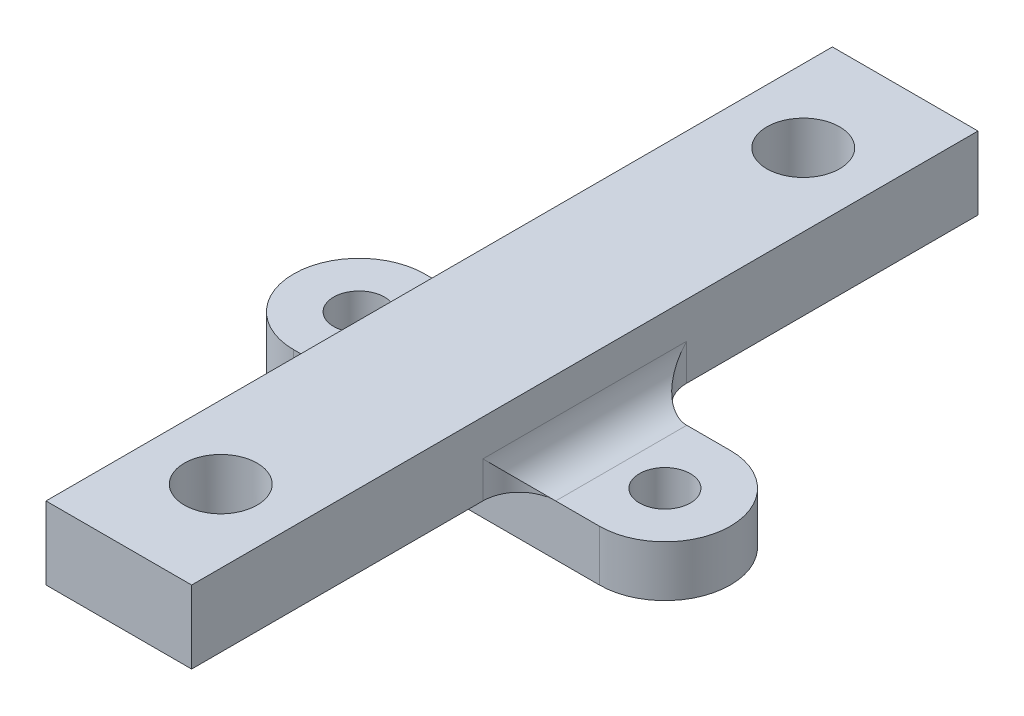
ISO-10303-21;
HEADER;
FILE_DESCRIPTION(('STEP AP214'),'2;1');
FILE_NAME('part.step','',(''),(''),'','','');
FILE_SCHEMA(('AUTOMOTIVE_DESIGN { 1 0 10303 214 1 1 1 1 }'));
ENDSEC;
DATA;
#1=APPLICATION_CONTEXT('core data for automotive mechanical design processes');
#2=APPLICATION_PROTOCOL_DEFINITION('international standard','automotive_design',2000,#1);
#3=PRODUCT_CONTEXT('',#1,'mechanical');
#4=PRODUCT('Part','Part','',(#3));
#5=PRODUCT_RELATED_PRODUCT_CATEGORY('part','',(#4));
#6=PRODUCT_DEFINITION_FORMATION('','',#4);
#7=PRODUCT_DEFINITION_CONTEXT('part definition',#1,'design');
#8=PRODUCT_DEFINITION('design','',#6,#7);
#9=PRODUCT_DEFINITION_SHAPE('','',#8);
#10=(LENGTH_UNIT() NAMED_UNIT(*) SI_UNIT(.MILLI.,.METRE.));
#11=(NAMED_UNIT(*) PLANE_ANGLE_UNIT() SI_UNIT($,.RADIAN.));
#12=(NAMED_UNIT(*) SI_UNIT($,.STERADIAN.) SOLID_ANGLE_UNIT());
#13=UNCERTAINTY_MEASURE_WITH_UNIT(LENGTH_MEASURE(1.E-05),#10,'distance_accuracy_value','');
#14=(GEOMETRIC_REPRESENTATION_CONTEXT(3) GLOBAL_UNCERTAINTY_ASSIGNED_CONTEXT((#13)) GLOBAL_UNIT_ASSIGNED_CONTEXT((#10,
#11,#12)) REPRESENTATION_CONTEXT('',''));
#15=CARTESIAN_POINT('',(0.,0.,0.));
#16=DIRECTION('',(0.,0.,1.));
#17=DIRECTION('',(1.,0.,0.));
#18=AXIS2_PLACEMENT_3D('',#15,#16,#17);
#19=CARTESIAN_POINT('',(-21.,7.,9.));
#20=DIRECTION('',(0.,0.,-1.));
#21=DIRECTION('',(-1.,0.,0.));
#22=AXIS2_PLACEMENT_3D('',#19,#20,#21);
#23=PLANE('',#22);
#24=DIRECTION('',(1.,0.,0.));
#25=VECTOR('',#24,1.);
#26=CARTESIAN_POINT('',(-10.,7.,9.));
#27=LINE('',#26,#25);
#28=CARTESIAN_POINT('',(-15.,7.,9.));
#29=VERTEX_POINT('',#28);
#30=CARTESIAN_POINT('',(15.,7.,9.));
#31=VERTEX_POINT('',#30);
#32=EDGE_CURVE('E183',#29,#31,#27,.T.);
#33=ORIENTED_EDGE('',*,*,#32,.F.);
#34=DIRECTION('',(1.,0.,0.));
#35=VECTOR('',#34,1.);
#36=CARTESIAN_POINT('',(-21.,7.,9.));
#37=LINE('',#36,#35);
#38=CARTESIAN_POINT('',(-21.,7.,9.));
#39=VERTEX_POINT('',#38);
#40=EDGE_CURVE('E244',#39,#29,#37,.T.);
#41=ORIENTED_EDGE('',*,*,#40,.F.);
#42=DIRECTION('',(0.,-1.,0.));
#43=VECTOR('',#42,1.);
#44=CARTESIAN_POINT('',(-21.,7.,9.));
#45=LINE('',#44,#43);
#46=CARTESIAN_POINT('',(-21.,0.,9.));
#47=VERTEX_POINT('',#46);
#48=EDGE_CURVE('E257',#39,#47,#45,.T.);
#49=ORIENTED_EDGE('',*,*,#48,.T.);
#50=DIRECTION('',(1.,0.,0.));
#51=VECTOR('',#50,1.);
#52=CARTESIAN_POINT('',(-21.,0.,9.));
#53=LINE('',#52,#51);
#54=CARTESIAN_POINT('',(21.,0.,9.));
#55=VERTEX_POINT('',#54);
#56=EDGE_CURVE('E237',#47,#55,#53,.T.);
#57=ORIENTED_EDGE('',*,*,#56,.T.);
#58=DIRECTION('',(0.,-1.,0.));
#59=VECTOR('',#58,1.);
#60=CARTESIAN_POINT('',(21.,7.,9.));
#61=LINE('',#60,#59);
#62=CARTESIAN_POINT('',(21.,7.,9.));
#63=VERTEX_POINT('',#62);
#64=EDGE_CURVE('E247',#63,#55,#61,.T.);
#65=ORIENTED_EDGE('',*,*,#64,.F.);
#66=EDGE_CURVE('E243',#31,#63,#37,.T.);
#67=ORIENTED_EDGE('',*,*,#66,.F.);
#68=EDGE_LOOP('',(#33,#41,#49,#57,#65,#67));
#69=FACE_BOUND('',#68,.T.);
#70=ADVANCED_FACE('F43',(#69),#23,.F.);
#71=CARTESIAN_POINT('',(21.,7.,0.));
#72=DIRECTION('',(0.,-1.,0.));
#73=DIRECTION('',(0.,0.,-1.));
#74=AXIS2_PLACEMENT_3D('',#71,#72,#73);
#75=PLANE('',#74);
#76=CARTESIAN_POINT('',(21.,7.,0.));
#77=DIRECTION('',(0.,-1.,0.));
#78=DIRECTION('',(0.,0.,1.));
#79=AXIS2_PLACEMENT_3D('',#76,#77,#78);
#80=CIRCLE('',#79,3.5);
#81=CARTESIAN_POINT('',(21.,7.,3.5));
#82=VERTEX_POINT('',#81);
#83=EDGE_CURVE('E203',#82,#82,#80,.T.);
#84=ORIENTED_EDGE('',*,*,#83,.T.);
#85=EDGE_LOOP('',(#84));
#86=FACE_BOUND('',#85,.T.);
#87=DIRECTION('',(-1.,0.,0.));
#88=VECTOR('',#87,1.);
#89=CARTESIAN_POINT('',(-21.,7.,-9.));
#90=LINE('',#89,#88);
#91=CARTESIAN_POINT('',(21.,7.,-9.));
#92=VERTEX_POINT('',#91);
#93=CARTESIAN_POINT('',(15.,7.,-9.));
#94=VERTEX_POINT('',#93);
#95=EDGE_CURVE('E238',#92,#94,#90,.T.);
#96=ORIENTED_EDGE('',*,*,#95,.T.);
#97=DIRECTION('',(0.,0.,-1.));
#98=VECTOR('',#97,1.);
#99=CARTESIAN_POINT('',(15.,7.,9.));
#100=LINE('',#99,#98);
#101=EDGE_CURVE('E270',#94,#31,#100,.F.);
#102=ORIENTED_EDGE('',*,*,#101,.T.);
#103=ORIENTED_EDGE('',*,*,#66,.T.);
#104=CARTESIAN_POINT('',(21.,7.,0.));
#105=DIRECTION('',(0.,1.,0.));
#106=DIRECTION('',(0.,0.,-1.));
#107=AXIS2_PLACEMENT_3D('',#104,#105,#106);
#108=CIRCLE('',#107,9.);
#109=EDGE_CURVE('E233',#63,#92,#108,.T.);
#110=ORIENTED_EDGE('',*,*,#109,.T.);
#111=EDGE_LOOP('',(#96,#102,#103,#110));
#112=FACE_BOUND('',#111,.T.);
#113=ADVANCED_FACE('F311',(#86,#112),#75,.F.);
#114=CARTESIAN_POINT('',(-21.,7.,0.));
#115=DIRECTION('',(0.,1.,0.));
#116=DIRECTION('',(0.,0.,1.));
#117=AXIS2_PLACEMENT_3D('',#114,#115,#116);
#118=CIRCLE('',#117,3.5);
#119=CARTESIAN_POINT('',(-21.,7.,3.5));
#120=VERTEX_POINT('',#119);
#121=EDGE_CURVE('E218',#120,#120,#118,.T.);
#122=ORIENTED_EDGE('',*,*,#121,.F.);
#123=EDGE_LOOP('',(#122));
#124=FACE_BOUND('',#123,.T.);
#125=ORIENTED_EDGE('',*,*,#40,.T.);
#126=DIRECTION('',(0.,0.,1.));
#127=VECTOR('',#126,1.);
#128=CARTESIAN_POINT('',(-15.,7.,-9.));
#129=LINE('',#128,#127);
#130=CARTESIAN_POINT('',(-15.,7.,-9.));
#131=VERTEX_POINT('',#130);
#132=EDGE_CURVE('E275',#29,#131,#129,.F.);
#133=ORIENTED_EDGE('',*,*,#132,.T.);
#134=CARTESIAN_POINT('',(-21.,7.,-9.));
#135=VERTEX_POINT('',#134);
#136=EDGE_CURVE('E236',#131,#135,#90,.T.);
#137=ORIENTED_EDGE('',*,*,#136,.T.);
#138=CARTESIAN_POINT('',(-21.,7.,0.));
#139=DIRECTION('',(0.,1.,0.));
#140=DIRECTION('',(0.,0.,1.));
#141=AXIS2_PLACEMENT_3D('',#138,#139,#140);
#142=CIRCLE('',#141,9.);
#143=EDGE_CURVE('E241',#135,#39,#142,.T.);
#144=ORIENTED_EDGE('',*,*,#143,.T.);
#145=EDGE_LOOP('',(#125,#133,#137,#144));
#146=FACE_BOUND('',#145,.T.);
#147=ADVANCED_FACE('F333',(#124,#146),#75,.F.);
#148=CARTESIAN_POINT('',(21.,7.,0.));
#149=DIRECTION('',(0.,-1.,0.));
#150=DIRECTION('',(0.,0.,-1.));
#151=AXIS2_PLACEMENT_3D('',#148,#149,#150);
#152=CYLINDRICAL_SURFACE('',#151,9.);
#153=CARTESIAN_POINT('',(21.,0.,0.));
#154=DIRECTION('',(0.,1.,0.));
#155=DIRECTION('',(0.,0.,-1.));
#156=AXIS2_PLACEMENT_3D('',#153,#154,#155);
#157=CIRCLE('',#156,9.);
#158=CARTESIAN_POINT('',(21.,0.,-9.));
#159=VERTEX_POINT('',#158);
#160=EDGE_CURVE('E230',#55,#159,#157,.T.);
#161=ORIENTED_EDGE('',*,*,#160,.T.);
#162=DIRECTION('',(0.,-1.,0.));
#163=VECTOR('',#162,1.);
#164=CARTESIAN_POINT('',(21.,7.,-9.));
#165=LINE('',#164,#163);
#166=EDGE_CURVE('E263',#92,#159,#165,.T.);
#167=ORIENTED_EDGE('',*,*,#166,.F.);
#168=ORIENTED_EDGE('',*,*,#109,.F.);
#169=ORIENTED_EDGE('',*,*,#64,.T.);
#170=EDGE_LOOP('',(#161,#167,#168,#169));
#171=FACE_BOUND('',#170,.T.);
#172=ADVANCED_FACE('F369',(#171),#152,.T.);
#173=CARTESIAN_POINT('',(-21.,7.,-9.));
#174=DIRECTION('',(0.,0.,1.));
#175=DIRECTION('',(1.,0.,0.));
#176=AXIS2_PLACEMENT_3D('',#173,#174,#175);
#177=PLANE('',#176);
#178=ORIENTED_EDGE('',*,*,#136,.F.);
#179=DIRECTION('',(1.,0.,0.));
#180=VECTOR('',#179,1.);
#181=CARTESIAN_POINT('',(-10.,7.,-9.));
#182=LINE('',#181,#180);
#183=EDGE_CURVE('E167',#131,#94,#182,.T.);
#184=ORIENTED_EDGE('',*,*,#183,.T.);
#185=ORIENTED_EDGE('',*,*,#95,.F.);
#186=ORIENTED_EDGE('',*,*,#166,.T.);
#187=DIRECTION('',(-1.,0.,0.));
#188=VECTOR('',#187,1.);
#189=CARTESIAN_POINT('',(-21.,0.,-9.));
#190=LINE('',#189,#188);
#191=CARTESIAN_POINT('',(-21.,0.,-9.));
#192=VERTEX_POINT('',#191);
#193=EDGE_CURVE('E250',#159,#192,#190,.T.);
#194=ORIENTED_EDGE('',*,*,#193,.T.);
#195=DIRECTION('',(0.,-1.,0.));
#196=VECTOR('',#195,1.);
#197=CARTESIAN_POINT('',(-21.,7.,-9.));
#198=LINE('',#197,#196);
#199=EDGE_CURVE('E260',#135,#192,#198,.T.);
#200=ORIENTED_EDGE('',*,*,#199,.F.);
#201=EDGE_LOOP('',(#178,#184,#185,#186,#194,#200));
#202=FACE_BOUND('',#201,.T.);
#203=ADVANCED_FACE('F337',(#202),#177,.F.);
#204=CARTESIAN_POINT('',(-21.,7.,0.));
#205=DIRECTION('',(0.,-1.,0.));
#206=DIRECTION('',(0.,0.,-1.));
#207=AXIS2_PLACEMENT_3D('',#204,#205,#206);
#208=CYLINDRICAL_SURFACE('',#207,9.);
#209=CARTESIAN_POINT('',(-21.,0.,0.));
#210=DIRECTION('',(0.,1.,0.));
#211=DIRECTION('',(0.,0.,1.));
#212=AXIS2_PLACEMENT_3D('',#209,#210,#211);
#213=CIRCLE('',#212,9.);
#214=EDGE_CURVE('E252',#192,#47,#213,.T.);
#215=ORIENTED_EDGE('',*,*,#214,.T.);
#216=ORIENTED_EDGE('',*,*,#48,.F.);
#217=ORIENTED_EDGE('',*,*,#143,.F.);
#218=ORIENTED_EDGE('',*,*,#199,.T.);
#219=EDGE_LOOP('',(#215,#216,#217,#218));
#220=FACE_BOUND('',#219,.T.);
#221=ADVANCED_FACE('F363',(#220),#208,.T.);
#222=CARTESIAN_POINT('',(21.,0.,0.));
#223=DIRECTION('',(0.,-1.,0.));
#224=DIRECTION('',(0.,0.,-1.));
#225=AXIS2_PLACEMENT_3D('',#222,#223,#224);
#226=PLANE('',#225);
#227=CARTESIAN_POINT('',(21.,0.,0.));
#228=DIRECTION('',(0.,-1.,0.));
#229=DIRECTION('',(0.,0.,-1.));
#230=AXIS2_PLACEMENT_3D('',#227,#228,#229);
#231=CIRCLE('',#230,3.);
#232=CARTESIAN_POINT('',(21.,0.,-3.));
#233=VERTEX_POINT('',#232);
#234=EDGE_CURVE('E266',#233,#233,#231,.T.);
#235=ORIENTED_EDGE('',*,*,#234,.F.);
#236=EDGE_LOOP('',(#235));
#237=FACE_BOUND('',#236,.T.);
#238=CARTESIAN_POINT('',(-21.,0.,0.));
#239=DIRECTION('',(0.,-1.,0.));
#240=DIRECTION('',(0.,0.,-1.));
#241=AXIS2_PLACEMENT_3D('',#238,#239,#240);
#242=CIRCLE('',#241,3.);
#243=CARTESIAN_POINT('',(-21.,0.,-3.));
#244=VERTEX_POINT('',#243);
#245=EDGE_CURVE('E224',#244,#244,#242,.T.);
#246=ORIENTED_EDGE('',*,*,#245,.F.);
#247=EDGE_LOOP('',(#246));
#248=FACE_BOUND('',#247,.T.);
#249=ORIENTED_EDGE('',*,*,#160,.F.);
#250=ORIENTED_EDGE('',*,*,#56,.F.);
#251=ORIENTED_EDGE('',*,*,#214,.F.);
#252=ORIENTED_EDGE('',*,*,#193,.F.);
#253=EDGE_LOOP('',(#249,#250,#251,#252));
#254=FACE_BOUND('',#253,.T.);
#255=ADVANCED_FACE('F362',(#237,#248,#254),#226,.T.);
#256=CARTESIAN_POINT('',(-21.,-1.,0.));
#257=DIRECTION('',(0.,1.,0.));
#258=DIRECTION('',(0.,0.,1.));
#259=AXIS2_PLACEMENT_3D('',#256,#257,#258);
#260=CYLINDRICAL_SURFACE('',#259,3.);
#261=CARTESIAN_POINT('',(-21.,-1.,0.));
#262=DIRECTION('',(0.,-1.,0.));
#263=DIRECTION('',(0.,0.,-1.));
#264=AXIS2_PLACEMENT_3D('',#261,#262,#263);
#265=CIRCLE('',#264,3.);
#266=CARTESIAN_POINT('',(-21.,-1.,-3.));
#267=VERTEX_POINT('',#266);
#268=EDGE_CURVE('E227',#267,#267,#265,.T.);
#269=ORIENTED_EDGE('',*,*,#268,.F.);
#270=EDGE_LOOP('',(#269));
#271=FACE_BOUND('',#270,.T.);
#272=ORIENTED_EDGE('',*,*,#245,.T.);
#273=EDGE_LOOP('',(#272));
#274=FACE_BOUND('',#273,.T.);
#275=ADVANCED_FACE('F576',(#271,#274),#260,.T.);
#276=CARTESIAN_POINT('',(-21.,-1.,0.));
#277=DIRECTION('',(0.,-1.,0.));
#278=DIRECTION('',(0.,0.,-1.));
#279=AXIS2_PLACEMENT_3D('',#276,#277,#278);
#280=PLANE('',#279);
#281=CARTESIAN_POINT('',(-21.,-1.,0.));
#282=DIRECTION('',(0.,1.,0.));
#283=DIRECTION('',(0.,0.,1.));
#284=AXIS2_PLACEMENT_3D('',#281,#282,#283);
#285=CIRCLE('',#284,1.5);
#286=CARTESIAN_POINT('',(-21.,-1.,1.5));
#287=VERTEX_POINT('',#286);
#288=EDGE_CURVE('E215',#287,#287,#285,.T.);
#289=ORIENTED_EDGE('',*,*,#288,.T.);
#290=EDGE_LOOP('',(#289));
#291=FACE_BOUND('',#290,.T.);
#292=ORIENTED_EDGE('',*,*,#268,.T.);
#293=EDGE_LOOP('',(#292));
#294=FACE_BOUND('',#293,.T.);
#295=ADVANCED_FACE('F568',(#291,#294),#280,.T.);
#296=CARTESIAN_POINT('',(-21.,2.,0.));
#297=DIRECTION('',(0.,1.,0.));
#298=DIRECTION('',(0.,0.,1.));
#299=AXIS2_PLACEMENT_3D('',#296,#297,#298);
#300=CYLINDRICAL_SURFACE('',#299,3.5);
#301=CARTESIAN_POINT('',(-21.,2.,0.));
#302=DIRECTION('',(0.,1.,0.));
#303=DIRECTION('',(0.,0.,1.));
#304=AXIS2_PLACEMENT_3D('',#301,#302,#303);
#305=CIRCLE('',#304,3.5);
#306=CARTESIAN_POINT('',(-21.,2.,3.5));
#307=VERTEX_POINT('',#306);
#308=EDGE_CURVE('E221',#307,#307,#305,.T.);
#309=ORIENTED_EDGE('',*,*,#308,.F.);
#310=EDGE_LOOP('',(#309));
#311=FACE_BOUND('',#310,.T.);
#312=ORIENTED_EDGE('',*,*,#121,.T.);
#313=EDGE_LOOP('',(#312));
#314=FACE_BOUND('',#313,.T.);
#315=ADVANCED_FACE('F559',(#311,#314),#300,.F.);
#316=CARTESIAN_POINT('',(-21.,2.,0.));
#317=DIRECTION('',(0.,1.,0.));
#318=DIRECTION('',(0.,0.,1.));
#319=AXIS2_PLACEMENT_3D('',#316,#317,#318);
#320=PLANE('',#319);
#321=CARTESIAN_POINT('',(-21.,2.,0.));
#322=DIRECTION('',(0.,1.,0.));
#323=DIRECTION('',(0.,0.,1.));
#324=AXIS2_PLACEMENT_3D('',#321,#322,#323);
#325=CIRCLE('',#324,1.5);
#326=CARTESIAN_POINT('',(-21.,2.,1.5));
#327=VERTEX_POINT('',#326);
#328=EDGE_CURVE('E214',#327,#327,#325,.T.);
#329=ORIENTED_EDGE('',*,*,#328,.F.);
#330=EDGE_LOOP('',(#329));
#331=FACE_BOUND('',#330,.T.);
#332=ORIENTED_EDGE('',*,*,#308,.T.);
#333=EDGE_LOOP('',(#332));
#334=FACE_BOUND('',#333,.T.);
#335=ADVANCED_FACE('F551',(#331,#334),#320,.T.);
#336=CARTESIAN_POINT('',(-21.,-1.,0.));
#337=DIRECTION('',(0.,1.,0.));
#338=DIRECTION('',(0.,0.,1.));
#339=AXIS2_PLACEMENT_3D('',#336,#337,#338);
#340=CYLINDRICAL_SURFACE('',#339,1.5);
#341=ORIENTED_EDGE('',*,*,#288,.F.);
#342=EDGE_LOOP('',(#341));
#343=FACE_BOUND('',#342,.T.);
#344=ORIENTED_EDGE('',*,*,#328,.T.);
#345=EDGE_LOOP('',(#344));
#346=FACE_BOUND('',#345,.T.);
#347=ADVANCED_FACE('F542',(#343,#346),#340,.F.);
#348=CARTESIAN_POINT('',(21.,-1.,0.));
#349=DIRECTION('',(0.,1.,0.));
#350=DIRECTION('',(0.,0.,1.));
#351=AXIS2_PLACEMENT_3D('',#348,#349,#350);
#352=CYLINDRICAL_SURFACE('',#351,3.);
#353=CARTESIAN_POINT('',(21.,-1.,0.));
#354=DIRECTION('',(0.,1.,0.));
#355=DIRECTION('',(0.,0.,-1.));
#356=AXIS2_PLACEMENT_3D('',#353,#354,#355);
#357=CIRCLE('',#356,3.);
#358=CARTESIAN_POINT('',(21.,-1.,-3.));
#359=VERTEX_POINT('',#358);
#360=EDGE_CURVE('E209',#359,#359,#357,.T.);
#361=ORIENTED_EDGE('',*,*,#360,.T.);
#362=EDGE_LOOP('',(#361));
#363=FACE_BOUND('',#362,.T.);
#364=ORIENTED_EDGE('',*,*,#234,.T.);
#365=EDGE_LOOP('',(#364));
#366=FACE_BOUND('',#365,.T.);
#367=ADVANCED_FACE('F534',(#363,#366),#352,.T.);
#368=CARTESIAN_POINT('',(21.,-1.,0.));
#369=DIRECTION('',(0.,-1.,0.));
#370=DIRECTION('',(0.,0.,-1.));
#371=AXIS2_PLACEMENT_3D('',#368,#369,#370);
#372=PLANE('',#371);
#373=CARTESIAN_POINT('',(21.,-1.,0.));
#374=DIRECTION('',(0.,-1.,0.));
#375=DIRECTION('',(0.,0.,1.));
#376=AXIS2_PLACEMENT_3D('',#373,#374,#375);
#377=CIRCLE('',#376,1.5);
#378=CARTESIAN_POINT('',(21.,-1.,1.5));
#379=VERTEX_POINT('',#378);
#380=EDGE_CURVE('E200',#379,#379,#377,.T.);
#381=ORIENTED_EDGE('',*,*,#380,.F.);
#382=EDGE_LOOP('',(#381));
#383=FACE_BOUND('',#382,.T.);
#384=ORIENTED_EDGE('',*,*,#360,.F.);
#385=EDGE_LOOP('',(#384));
#386=FACE_BOUND('',#385,.T.);
#387=ADVANCED_FACE('F526',(#383,#386),#372,.T.);
#388=CARTESIAN_POINT('',(21.,2.,0.));
#389=DIRECTION('',(0.,1.,0.));
#390=DIRECTION('',(0.,0.,1.));
#391=AXIS2_PLACEMENT_3D('',#388,#389,#390);
#392=CYLINDRICAL_SURFACE('',#391,3.5);
#393=CARTESIAN_POINT('',(21.,2.,0.));
#394=DIRECTION('',(0.,-1.,0.));
#395=DIRECTION('',(0.,0.,1.));
#396=AXIS2_PLACEMENT_3D('',#393,#394,#395);
#397=CIRCLE('',#396,3.5);
#398=CARTESIAN_POINT('',(21.,2.,3.5));
#399=VERTEX_POINT('',#398);
#400=EDGE_CURVE('E206',#399,#399,#397,.T.);
#401=ORIENTED_EDGE('',*,*,#400,.T.);
#402=EDGE_LOOP('',(#401));
#403=FACE_BOUND('',#402,.T.);
#404=ORIENTED_EDGE('',*,*,#83,.F.);
#405=EDGE_LOOP('',(#404));
#406=FACE_BOUND('',#405,.T.);
#407=ADVANCED_FACE('F518',(#403,#406),#392,.F.);
#408=CARTESIAN_POINT('',(21.,2.,0.));
#409=DIRECTION('',(0.,1.,0.));
#410=DIRECTION('',(0.,0.,1.));
#411=AXIS2_PLACEMENT_3D('',#408,#409,#410);
#412=PLANE('',#411);
#413=CARTESIAN_POINT('',(21.,2.,0.));
#414=DIRECTION('',(0.,-1.,0.));
#415=DIRECTION('',(0.,0.,1.));
#416=AXIS2_PLACEMENT_3D('',#413,#414,#415);
#417=CIRCLE('',#416,1.5);
#418=CARTESIAN_POINT('',(21.,2.,1.5));
#419=VERTEX_POINT('',#418);
#420=EDGE_CURVE('E156',#419,#419,#417,.T.);
#421=ORIENTED_EDGE('',*,*,#420,.T.);
#422=EDGE_LOOP('',(#421));
#423=FACE_BOUND('',#422,.T.);
#424=ORIENTED_EDGE('',*,*,#400,.F.);
#425=EDGE_LOOP('',(#424));
#426=FACE_BOUND('',#425,.T.);
#427=ADVANCED_FACE('F510',(#423,#426),#412,.T.);
#428=CARTESIAN_POINT('',(21.,-1.,0.));
#429=DIRECTION('',(0.,1.,0.));
#430=DIRECTION('',(0.,0.,1.));
#431=AXIS2_PLACEMENT_3D('',#428,#429,#430);
#432=CYLINDRICAL_SURFACE('',#431,1.5);
#433=ORIENTED_EDGE('',*,*,#380,.T.);
#434=EDGE_LOOP('',(#433));
#435=FACE_BOUND('',#434,.T.);
#436=ORIENTED_EDGE('',*,*,#420,.F.);
#437=EDGE_LOOP('',(#436));
#438=FACE_BOUND('',#437,.T.);
#439=ADVANCED_FACE('F477',(#435,#438),#432,.F.);
#440=CARTESIAN_POINT('',(10.,17.,-9.));
#441=DIRECTION('',(-1.,0.,0.));
#442=DIRECTION('',(0.,0.,1.));
#443=AXIS2_PLACEMENT_3D('',#440,#441,#442);
#444=PLANE('',#443);
#445=DIRECTION('',(0.,0.,-1.));
#446=VECTOR('',#445,1.);
#447=CARTESIAN_POINT('',(10.,12.,-9.));
#448=LINE('',#447,#446);
#449=CARTESIAN_POINT('',(10.,12.,14.));
#450=VERTEX_POINT('',#449);
#451=CARTESIAN_POINT('',(10.,12.,-14.));
#452=VERTEX_POINT('',#451);
#453=EDGE_CURVE('E58',#450,#452,#448,.T.);
#454=ORIENTED_EDGE('',*,*,#453,.T.);
#455=DIRECTION('',(0.,-1.,0.));
#456=VECTOR('',#455,1.);
#457=CARTESIAN_POINT('',(10.,7.,-14.));
#458=LINE('',#457,#456);
#459=CARTESIAN_POINT('',(9.99999999999999,7.,-14.));
#460=VERTEX_POINT('',#459);
#461=EDGE_CURVE('E286',#452,#460,#458,.T.);
#462=ORIENTED_EDGE('',*,*,#461,.T.);
#463=DIRECTION('',(0.,0.,1.));
#464=VECTOR('',#463,1.);
#465=CARTESIAN_POINT('',(9.99999999999999,7.,-54.));
#466=LINE('',#465,#464);
#467=CARTESIAN_POINT('',(9.99999999999999,7.,-54.));
#468=VERTEX_POINT('',#467);
#469=EDGE_CURVE('E180',#468,#460,#466,.T.);
#470=ORIENTED_EDGE('',*,*,#469,.F.);
#471=DIRECTION('',(0.,1.,0.));
#472=VECTOR('',#471,1.);
#473=CARTESIAN_POINT('',(9.99999999999999,17.,-54.));
#474=LINE('',#473,#472);
#475=CARTESIAN_POINT('',(9.99999999999999,17.,-54.));
#476=VERTEX_POINT('',#475);
#477=EDGE_CURVE('E170',#468,#476,#474,.T.);
#478=ORIENTED_EDGE('',*,*,#477,.T.);
#479=DIRECTION('',(0.,0.,-1.));
#480=VECTOR('',#479,1.);
#481=CARTESIAN_POINT('',(10.,17.,-9.));
#482=LINE('',#481,#480);
#483=CARTESIAN_POINT('',(9.99999999999999,17.,54.));
#484=VERTEX_POINT('',#483);
#485=EDGE_CURVE('E157',#484,#476,#482,.T.);
#486=ORIENTED_EDGE('',*,*,#485,.F.);
#487=DIRECTION('',(0.,1.,0.));
#488=VECTOR('',#487,1.);
#489=CARTESIAN_POINT('',(9.99999999999999,17.,54.));
#490=LINE('',#489,#488);
#491=CARTESIAN_POINT('',(9.99999999999999,7.,54.));
#492=VERTEX_POINT('',#491);
#493=EDGE_CURVE('E187',#492,#484,#490,.T.);
#494=ORIENTED_EDGE('',*,*,#493,.F.);
#495=DIRECTION('',(0.,0.,-1.));
#496=VECTOR('',#495,1.);
#497=CARTESIAN_POINT('',(9.99999999999999,7.,54.));
#498=LINE('',#497,#496);
#499=CARTESIAN_POINT('',(9.99999999999999,7.,14.));
#500=VERTEX_POINT('',#499);
#501=EDGE_CURVE('E192',#492,#500,#498,.T.);
#502=ORIENTED_EDGE('',*,*,#501,.T.);
#503=DIRECTION('',(0.,1.,0.));
#504=VECTOR('',#503,1.);
#505=CARTESIAN_POINT('',(10.,12.,14.));
#506=LINE('',#505,#504);
#507=EDGE_CURVE('E284',#500,#450,#506,.T.);
#508=ORIENTED_EDGE('',*,*,#507,.T.);
#509=EDGE_LOOP('',(#454,#462,#470,#478,#486,#494,#502,#508));
#510=FACE_BOUND('',#509,.T.);
#511=ADVANCED_FACE('F320',(#510),#444,.F.);
#512=CARTESIAN_POINT('',(-10.,17.,-9.));
#513=DIRECTION('',(1.,0.,0.));
#514=DIRECTION('',(0.,0.,-1.));
#515=AXIS2_PLACEMENT_3D('',#512,#513,#514);
#516=PLANE('',#515);
#517=DIRECTION('',(0.,0.,1.));
#518=VECTOR('',#517,1.);
#519=CARTESIAN_POINT('',(-10.,12.,9.));
#520=LINE('',#519,#518);
#521=CARTESIAN_POINT('',(-10.,12.,-14.));
#522=VERTEX_POINT('',#521);
#523=CARTESIAN_POINT('',(-10.,12.,14.));
#524=VERTEX_POINT('',#523);
#525=EDGE_CURVE('E273',#522,#524,#520,.T.);
#526=ORIENTED_EDGE('',*,*,#525,.T.);
#527=DIRECTION('',(0.,-1.,0.));
#528=VECTOR('',#527,1.);
#529=CARTESIAN_POINT('',(-10.,7.,14.));
#530=LINE('',#529,#528);
#531=CARTESIAN_POINT('',(-10.,7.,14.));
#532=VERTEX_POINT('',#531);
#533=EDGE_CURVE('E281',#524,#532,#530,.T.);
#534=ORIENTED_EDGE('',*,*,#533,.T.);
#535=DIRECTION('',(0.,0.,-1.));
#536=VECTOR('',#535,1.);
#537=CARTESIAN_POINT('',(-10.,7.,54.));
#538=LINE('',#537,#536);
#539=CARTESIAN_POINT('',(-10.,7.,54.));
#540=VERTEX_POINT('',#539);
#541=EDGE_CURVE('E196',#540,#532,#538,.T.);
#542=ORIENTED_EDGE('',*,*,#541,.F.);
#543=DIRECTION('',(0.,-1.,0.));
#544=VECTOR('',#543,1.);
#545=CARTESIAN_POINT('',(-10.,17.,54.));
#546=LINE('',#545,#544);
#547=CARTESIAN_POINT('',(-10.,17.,54.));
#548=VERTEX_POINT('',#547);
#549=EDGE_CURVE('E151',#548,#540,#546,.T.);
#550=ORIENTED_EDGE('',*,*,#549,.F.);
#551=DIRECTION('',(0.,0.,1.));
#552=VECTOR('',#551,1.);
#553=CARTESIAN_POINT('',(-10.,17.,-9.));
#554=LINE('',#553,#552);
#555=CARTESIAN_POINT('',(-10.,17.,-54.));
#556=VERTEX_POINT('',#555);
#557=EDGE_CURVE('E143',#556,#548,#554,.T.);
#558=ORIENTED_EDGE('',*,*,#557,.F.);
#559=DIRECTION('',(0.,-1.,0.));
#560=VECTOR('',#559,1.);
#561=CARTESIAN_POINT('',(-10.,17.,-54.));
#562=LINE('',#561,#560);
#563=CARTESIAN_POINT('',(-10.,7.,-54.));
#564=VERTEX_POINT('',#563);
#565=EDGE_CURVE('E147',#556,#564,#562,.T.);
#566=ORIENTED_EDGE('',*,*,#565,.T.);
#567=DIRECTION('',(0.,0.,1.));
#568=VECTOR('',#567,1.);
#569=CARTESIAN_POINT('',(-10.,7.,-54.));
#570=LINE('',#569,#568);
#571=CARTESIAN_POINT('',(-10.,7.,-14.));
#572=VERTEX_POINT('',#571);
#573=EDGE_CURVE('E176',#564,#572,#570,.T.);
#574=ORIENTED_EDGE('',*,*,#573,.T.);
#575=DIRECTION('',(0.,1.,0.));
#576=VECTOR('',#575,1.);
#577=CARTESIAN_POINT('',(-10.,12.,-14.));
#578=LINE('',#577,#576);
#579=EDGE_CURVE('E278',#572,#522,#578,.T.);
#580=ORIENTED_EDGE('',*,*,#579,.T.);
#581=EDGE_LOOP('',(#526,#534,#542,#550,#558,#566,#574,#580));
#582=FACE_BOUND('',#581,.T.);
#583=ADVANCED_FACE('F145',(#582),#516,.F.);
#584=CARTESIAN_POINT('',(0.,17.,0.));
#585=DIRECTION('',(0.,1.,0.));
#586=DIRECTION('',(0.,0.,1.));
#587=AXIS2_PLACEMENT_3D('',#584,#585,#586);
#588=PLANE('',#587);
#589=CARTESIAN_POINT('',(0.,17.,40.));
#590=DIRECTION('',(0.,-1.,0.));
#591=DIRECTION('',(0.,0.,-1.));
#592=AXIS2_PLACEMENT_3D('',#589,#590,#591);
#593=CIRCLE('',#592,5.);
#594=CARTESIAN_POINT('',(0.,17.,35.));
#595=VERTEX_POINT('',#594);
#596=EDGE_CURVE('E692',#595,#595,#593,.T.);
#597=ORIENTED_EDGE('',*,*,#596,.T.);
#598=EDGE_LOOP('',(#597));
#599=FACE_BOUND('',#598,.T.);
#600=CARTESIAN_POINT('',(0.,17.,-40.));
#601=DIRECTION('',(0.,1.,0.));
#602=DIRECTION('',(0.,0.,1.));
#603=AXIS2_PLACEMENT_3D('',#600,#601,#602);
#604=CIRCLE('',#603,5.);
#605=CARTESIAN_POINT('',(0.,17.,-35.));
#606=VERTEX_POINT('',#605);
#607=EDGE_CURVE('E178',#606,#606,#604,.T.);
#608=ORIENTED_EDGE('',*,*,#607,.F.);
#609=EDGE_LOOP('',(#608));
#610=FACE_BOUND('',#609,.T.);
#611=ORIENTED_EDGE('',*,*,#485,.T.);
#612=DIRECTION('',(-1.,0.,0.));
#613=VECTOR('',#612,1.);
#614=CARTESIAN_POINT('',(-10.,17.,-54.));
#615=LINE('',#614,#613);
#616=EDGE_CURVE('E163',#476,#556,#615,.T.);
#617=ORIENTED_EDGE('',*,*,#616,.T.);
#618=ORIENTED_EDGE('',*,*,#557,.T.);
#619=DIRECTION('',(-1.,0.,0.));
#620=VECTOR('',#619,1.);
#621=CARTESIAN_POINT('',(-10.,17.,54.));
#622=LINE('',#621,#620);
#623=EDGE_CURVE('E190',#484,#548,#622,.T.);
#624=ORIENTED_EDGE('',*,*,#623,.F.);
#625=EDGE_LOOP('',(#611,#617,#618,#624));
#626=FACE_BOUND('',#625,.T.);
#627=ADVANCED_FACE('F169',(#599,#610,#626),#588,.T.);
#628=CARTESIAN_POINT('',(-10.,7.,54.));
#629=DIRECTION('',(0.,1.,0.));
#630=DIRECTION('',(0.,0.,1.));
#631=AXIS2_PLACEMENT_3D('',#628,#629,#630);
#632=PLANE('',#631);
#633=CARTESIAN_POINT('',(0.,7.,40.));
#634=DIRECTION('',(0.,1.,0.));
#635=DIRECTION('',(0.,0.,1.));
#636=AXIS2_PLACEMENT_3D('',#633,#634,#635);
#637=CIRCLE('',#636,5.);
#638=CARTESIAN_POINT('',(0.,7.,45.));
#639=VERTEX_POINT('',#638);
#640=EDGE_CURVE('E690',#639,#639,#637,.T.);
#641=ORIENTED_EDGE('',*,*,#640,.T.);
#642=EDGE_LOOP('',(#641));
#643=FACE_BOUND('',#642,.T.);
#644=ORIENTED_EDGE('',*,*,#32,.T.);
#645=CARTESIAN_POINT('',(15.,7.,14.));
#646=DIRECTION('',(0.,1.,0.));
#647=DIRECTION('',(0.,0.,1.));
#648=AXIS2_PLACEMENT_3D('',#645,#646,#647);
#649=CIRCLE('',#648,5.);
#650=EDGE_CURVE('E11',#31,#500,#649,.T.);
#651=ORIENTED_EDGE('',*,*,#650,.T.);
#652=ORIENTED_EDGE('',*,*,#501,.F.);
#653=DIRECTION('',(1.,0.,0.));
#654=VECTOR('',#653,1.);
#655=CARTESIAN_POINT('',(-10.,7.,54.));
#656=LINE('',#655,#654);
#657=EDGE_CURVE('E185',#540,#492,#656,.T.);
#658=ORIENTED_EDGE('',*,*,#657,.F.);
#659=ORIENTED_EDGE('',*,*,#541,.T.);
#660=CARTESIAN_POINT('',(-15.,7.,14.));
#661=DIRECTION('',(0.,1.,0.));
#662=DIRECTION('',(0.,0.,1.));
#663=AXIS2_PLACEMENT_3D('',#660,#661,#662);
#664=CIRCLE('',#663,5.);
#665=EDGE_CURVE('E288',#532,#29,#664,.T.);
#666=ORIENTED_EDGE('',*,*,#665,.T.);
#667=EDGE_LOOP('',(#644,#651,#652,#658,#659,#666));
#668=FACE_BOUND('',#667,.T.);
#669=ADVANCED_FACE('F318',(#643,#668),#632,.F.);
#670=CARTESIAN_POINT('',(0.,0.,54.));
#671=DIRECTION('',(0.,0.,1.));
#672=DIRECTION('',(1.,0.,0.));
#673=AXIS2_PLACEMENT_3D('',#670,#671,#672);
#674=PLANE('',#673);
#675=ORIENTED_EDGE('',*,*,#549,.T.);
#676=ORIENTED_EDGE('',*,*,#657,.T.);
#677=ORIENTED_EDGE('',*,*,#493,.T.);
#678=ORIENTED_EDGE('',*,*,#623,.T.);
#679=EDGE_LOOP('',(#675,#676,#677,#678));
#680=FACE_BOUND('',#679,.T.);
#681=ADVANCED_FACE('F322',(#680),#674,.T.);
#682=CARTESIAN_POINT('',(-10.,7.,-54.));
#683=DIRECTION('',(0.,-1.,0.));
#684=DIRECTION('',(0.,0.,-1.));
#685=AXIS2_PLACEMENT_3D('',#682,#683,#684);
#686=PLANE('',#685);
#687=CARTESIAN_POINT('',(0.,7.,-40.));
#688=DIRECTION('',(0.,-1.,0.));
#689=DIRECTION('',(0.,0.,-1.));
#690=AXIS2_PLACEMENT_3D('',#687,#688,#689);
#691=CIRCLE('',#690,5.);
#692=CARTESIAN_POINT('',(0.,7.,-45.));
#693=VERTEX_POINT('',#692);
#694=EDGE_CURVE('E695',#693,#693,#691,.F.);
#695=ORIENTED_EDGE('',*,*,#694,.T.);
#696=EDGE_LOOP('',(#695));
#697=FACE_BOUND('',#696,.T.);
#698=ORIENTED_EDGE('',*,*,#183,.F.);
#699=CARTESIAN_POINT('',(-15.,7.,-14.));
#700=DIRECTION('',(0.,-1.,0.));
#701=DIRECTION('',(0.,0.,-1.));
#702=AXIS2_PLACEMENT_3D('',#699,#700,#701);
#703=CIRCLE('',#702,5.);
#704=EDGE_CURVE('E297',#131,#572,#703,.F.);
#705=ORIENTED_EDGE('',*,*,#704,.T.);
#706=ORIENTED_EDGE('',*,*,#573,.F.);
#707=DIRECTION('',(1.,0.,0.));
#708=VECTOR('',#707,1.);
#709=CARTESIAN_POINT('',(-10.,7.,-54.));
#710=LINE('',#709,#708);
#711=EDGE_CURVE('E166',#564,#468,#710,.T.);
#712=ORIENTED_EDGE('',*,*,#711,.T.);
#713=ORIENTED_EDGE('',*,*,#469,.T.);
#714=CARTESIAN_POINT('',(15.,7.,-14.));
#715=DIRECTION('',(0.,-1.,0.));
#716=DIRECTION('',(0.,0.,-1.));
#717=AXIS2_PLACEMENT_3D('',#714,#715,#716);
#718=CIRCLE('',#717,5.);
#719=EDGE_CURVE('E299',#460,#94,#718,.F.);
#720=ORIENTED_EDGE('',*,*,#719,.T.);
#721=EDGE_LOOP('',(#698,#705,#706,#712,#713,#720));
#722=FACE_BOUND('',#721,.T.);
#723=ADVANCED_FACE('F343',(#697,#722),#686,.T.);
#724=CARTESIAN_POINT('',(0.,0.,-54.));
#725=DIRECTION('',(0.,0.,-1.));
#726=DIRECTION('',(1.,0.,0.));
#727=AXIS2_PLACEMENT_3D('',#724,#725,#726);
#728=PLANE('',#727);
#729=ORIENTED_EDGE('',*,*,#565,.F.);
#730=ORIENTED_EDGE('',*,*,#616,.F.);
#731=ORIENTED_EDGE('',*,*,#477,.F.);
#732=ORIENTED_EDGE('',*,*,#711,.F.);
#733=EDGE_LOOP('',(#729,#730,#731,#732));
#734=FACE_BOUND('',#733,.T.);
#735=ADVANCED_FACE('F161',(#734),#728,.T.);
#736=CARTESIAN_POINT('',(0.,-1.001,-40.));
#737=DIRECTION('',(0.,1.,0.));
#738=DIRECTION('',(0.,0.,1.));
#739=AXIS2_PLACEMENT_3D('',#736,#737,#738);
#740=CYLINDRICAL_SURFACE('',#739,5.);
#741=ORIENTED_EDGE('',*,*,#694,.F.);
#742=EDGE_LOOP('',(#741));
#743=FACE_BOUND('',#742,.T.);
#744=ORIENTED_EDGE('',*,*,#607,.T.);
#745=EDGE_LOOP('',(#744));
#746=FACE_BOUND('',#745,.T.);
#747=ADVANCED_FACE('F419',(#743,#746),#740,.F.);
#748=CARTESIAN_POINT('',(0.,-1.001,40.));
#749=DIRECTION('',(0.,1.,0.));
#750=DIRECTION('',(0.,0.,1.));
#751=AXIS2_PLACEMENT_3D('',#748,#749,#750);
#752=CYLINDRICAL_SURFACE('',#751,5.);
#753=ORIENTED_EDGE('',*,*,#596,.F.);
#754=EDGE_LOOP('',(#753));
#755=FACE_BOUND('',#754,.T.);
#756=ORIENTED_EDGE('',*,*,#640,.F.);
#757=EDGE_LOOP('',(#756));
#758=FACE_BOUND('',#757,.T.);
#759=ADVANCED_FACE('F375',(#755,#758),#752,.F.);
#760=CARTESIAN_POINT('',(15.,12.,-9.));
#761=DIRECTION('',(0.,0.,1.));
#762=DIRECTION('',(1.,0.,0.));
#763=AXIS2_PLACEMENT_3D('',#760,#761,#762);
#764=CYLINDRICAL_SURFACE('',#763,5.);
#765=ORIENTED_EDGE('',*,*,#453,.F.);
#766=CARTESIAN_POINT('',(15.,12.,14.));
#767=DIRECTION('',(0.,-0.707106781186547,0.707106781186547));
#768=DIRECTION('',(0.,0.707106781186547,0.707106781186547));
#769=AXIS2_PLACEMENT_3D('',#766,#767,#768);
#770=ELLIPSE('',#769,7.07106781186547,5.);
#771=EDGE_CURVE('E51',#450,#31,#770,.T.);
#772=ORIENTED_EDGE('',*,*,#771,.T.);
#773=ORIENTED_EDGE('',*,*,#101,.F.);
#774=CARTESIAN_POINT('',(15.,12.,-14.));
#775=DIRECTION('',(0.,0.707106781186547,0.707106781186547));
#776=DIRECTION('',(0.,-0.707106781186547,0.707106781186547));
#777=AXIS2_PLACEMENT_3D('',#774,#775,#776);
#778=ELLIPSE('',#777,7.07106781186547,5.);
#779=EDGE_CURVE('E302',#94,#452,#778,.F.);
#780=ORIENTED_EDGE('',*,*,#779,.T.);
#781=EDGE_LOOP('',(#765,#772,#773,#780));
#782=FACE_BOUND('',#781,.T.);
#783=ADVANCED_FACE('F304',(#782),#764,.F.);
#784=CARTESIAN_POINT('',(-15.,12.,-9.));
#785=DIRECTION('',(0.,0.,-1.));
#786=DIRECTION('',(-1.,0.,0.));
#787=AXIS2_PLACEMENT_3D('',#784,#785,#786);
#788=CYLINDRICAL_SURFACE('',#787,5.);
#789=ORIENTED_EDGE('',*,*,#525,.F.);
#790=CARTESIAN_POINT('',(-15.,12.,-14.));
#791=DIRECTION('',(0.,-0.707106781186547,-0.707106781186547));
#792=DIRECTION('',(0.,0.707106781186547,-0.707106781186547));
#793=AXIS2_PLACEMENT_3D('',#790,#791,#792);
#794=ELLIPSE('',#793,7.07106781186547,5.);
#795=EDGE_CURVE('E294',#522,#131,#794,.T.);
#796=ORIENTED_EDGE('',*,*,#795,.T.);
#797=ORIENTED_EDGE('',*,*,#132,.F.);
#798=CARTESIAN_POINT('',(-15.,12.,14.));
#799=DIRECTION('',(0.,0.707106781186547,-0.707106781186547));
#800=DIRECTION('',(0.,-0.707106781186547,-0.707106781186547));
#801=AXIS2_PLACEMENT_3D('',#798,#799,#800);
#802=ELLIPSE('',#801,7.07106781186547,5.);
#803=EDGE_CURVE('E291',#29,#524,#802,.F.);
#804=ORIENTED_EDGE('',*,*,#803,.T.);
#805=EDGE_LOOP('',(#789,#796,#797,#804));
#806=FACE_BOUND('',#805,.T.);
#807=ADVANCED_FACE('F329',(#806),#788,.F.);
#808=CARTESIAN_POINT('',(-15.,17.,14.));
#809=DIRECTION('',(0.,1.,0.));
#810=DIRECTION('',(0.,0.,1.));
#811=AXIS2_PLACEMENT_3D('',#808,#809,#810);
#812=CYLINDRICAL_SURFACE('',#811,5.);
#813=ORIENTED_EDGE('',*,*,#533,.F.);
#814=ORIENTED_EDGE('',*,*,#803,.F.);
#815=ORIENTED_EDGE('',*,*,#665,.F.);
#816=EDGE_LOOP('',(#813,#814,#815));
#817=FACE_BOUND('',#816,.T.);
#818=ADVANCED_FACE('F326',(#817),#812,.F.);
#819=CARTESIAN_POINT('',(-15.,17.,-14.));
#820=DIRECTION('',(0.,-1.,0.));
#821=DIRECTION('',(0.,0.,-1.));
#822=AXIS2_PLACEMENT_3D('',#819,#820,#821);
#823=CYLINDRICAL_SURFACE('',#822,5.);
#824=ORIENTED_EDGE('',*,*,#579,.F.);
#825=ORIENTED_EDGE('',*,*,#704,.F.);
#826=ORIENTED_EDGE('',*,*,#795,.F.);
#827=EDGE_LOOP('',(#824,#825,#826));
#828=FACE_BOUND('',#827,.T.);
#829=ADVANCED_FACE('F341',(#828),#823,.F.);
#830=CARTESIAN_POINT('',(15.,17.,-14.));
#831=DIRECTION('',(0.,1.,0.));
#832=DIRECTION('',(0.,0.,1.));
#833=AXIS2_PLACEMENT_3D('',#830,#831,#832);
#834=CYLINDRICAL_SURFACE('',#833,5.);
#835=ORIENTED_EDGE('',*,*,#461,.F.);
#836=ORIENTED_EDGE('',*,*,#779,.F.);
#837=ORIENTED_EDGE('',*,*,#719,.F.);
#838=EDGE_LOOP('',(#835,#836,#837));
#839=FACE_BOUND('',#838,.T.);
#840=ADVANCED_FACE('F346',(#839),#834,.F.);
#841=CARTESIAN_POINT('',(15.,17.,14.));
#842=DIRECTION('',(0.,-1.,0.));
#843=DIRECTION('',(0.,0.,-1.));
#844=AXIS2_PLACEMENT_3D('',#841,#842,#843);
#845=CYLINDRICAL_SURFACE('',#844,5.);
#846=ORIENTED_EDGE('',*,*,#507,.F.);
#847=ORIENTED_EDGE('',*,*,#650,.F.);
#848=ORIENTED_EDGE('',*,*,#771,.F.);
#849=EDGE_LOOP('',(#846,#847,#848));
#850=FACE_BOUND('',#849,.T.);
#851=ADVANCED_FACE('F45',(#850),#845,.F.);
#852=CLOSED_SHELL('',(#70,#113,#147,#172,#203,#221,#255,#275,#295,#315,#335,#347,#367,#387,#407,
#427,#439,#511,#583,#627,#669,#681,#723,#735,#747,#759,#783,#807,#818,#829,#840,#851));
#853=MANIFOLD_SOLID_BREP('B2',#852);
#854=ADVANCED_BREP_SHAPE_REPRESENTATION('',(#18,#853),#14);
#855=SHAPE_DEFINITION_REPRESENTATION(#9,#854);
ENDSEC;
END-ISO-10303-21;
